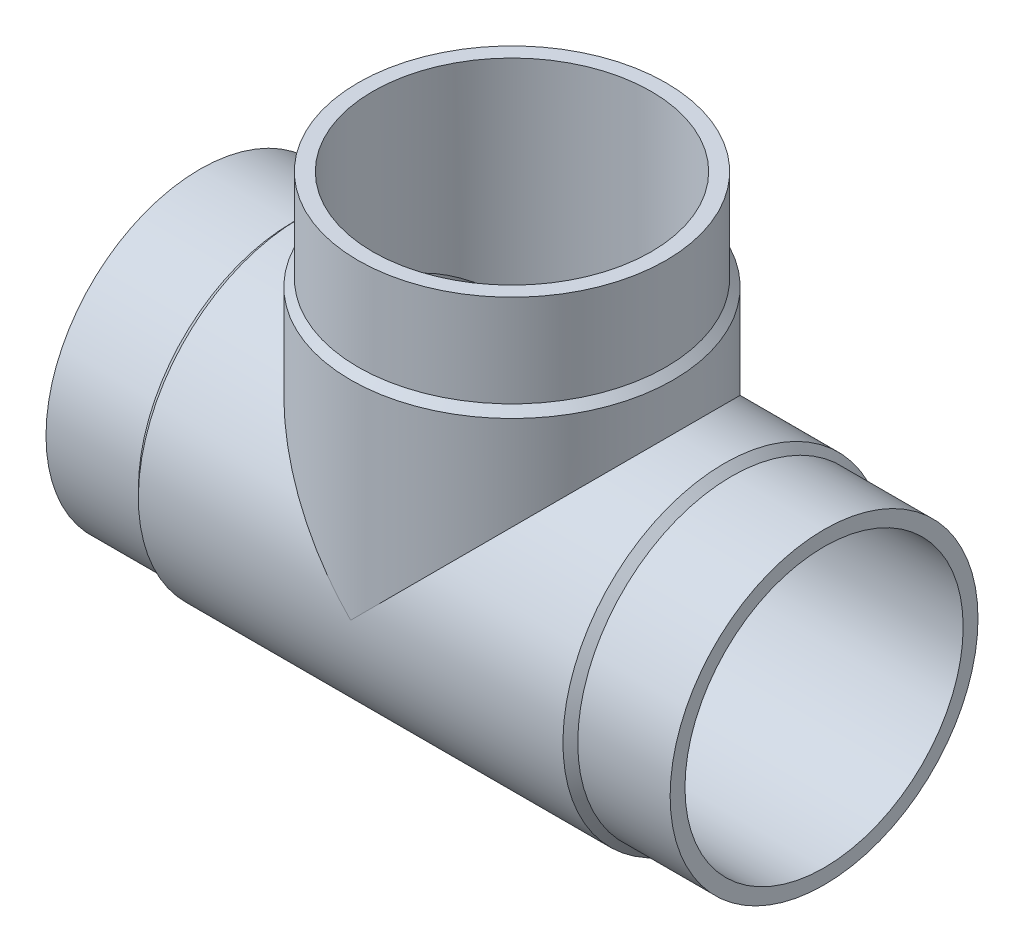
ISO-10303-21;
HEADER;
FILE_DESCRIPTION(('STEP AP214'),'2;1');
FILE_NAME('part.step','',(''),(''),'','','');
FILE_SCHEMA(('AUTOMOTIVE_DESIGN { 1 0 10303 214 1 1 1 1 }'));
ENDSEC;
DATA;
#1=APPLICATION_CONTEXT('core data for automotive mechanical design processes');
#2=APPLICATION_PROTOCOL_DEFINITION('international standard','automotive_design',2000,#1);
#3=PRODUCT_CONTEXT('',#1,'mechanical');
#4=PRODUCT('Part','Part','',(#3));
#5=PRODUCT_RELATED_PRODUCT_CATEGORY('part','',(#4));
#6=PRODUCT_DEFINITION_FORMATION('','',#4);
#7=PRODUCT_DEFINITION_CONTEXT('part definition',#1,'design');
#8=PRODUCT_DEFINITION('design','',#6,#7);
#9=PRODUCT_DEFINITION_SHAPE('','',#8);
#10=(LENGTH_UNIT() NAMED_UNIT(*) SI_UNIT(.MILLI.,.METRE.));
#11=(NAMED_UNIT(*) PLANE_ANGLE_UNIT() SI_UNIT($,.RADIAN.));
#12=(NAMED_UNIT(*) SI_UNIT($,.STERADIAN.) SOLID_ANGLE_UNIT());
#13=UNCERTAINTY_MEASURE_WITH_UNIT(LENGTH_MEASURE(1.E-05),#10,'distance_accuracy_value','');
#14=(GEOMETRIC_REPRESENTATION_CONTEXT(3) GLOBAL_UNCERTAINTY_ASSIGNED_CONTEXT((#13)) GLOBAL_UNIT_ASSIGNED_CONTEXT((#10,
#11,#12)) REPRESENTATION_CONTEXT('',''));
#15=CARTESIAN_POINT('',(0.,0.,0.));
#16=DIRECTION('',(0.,0.,1.));
#17=DIRECTION('',(1.,0.,0.));
#18=AXIS2_PLACEMENT_3D('',#15,#16,#17);
#19=CARTESIAN_POINT('',(-111.5,110.,0.));
#20=DIRECTION('',(0.,1.,0.));
#21=DIRECTION('',(0.,0.,1.));
#22=AXIS2_PLACEMENT_3D('',#19,#20,#21);
#23=CYLINDRICAL_SURFACE('',#22,55.);
#24=CARTESIAN_POINT('',(-111.5,110.,0.));
#25=DIRECTION('',(0.,1.,0.));
#26=DIRECTION('',(0.,0.,1.));
#27=AXIS2_PLACEMENT_3D('',#24,#25,#26);
#28=CIRCLE('',#27,55.);
#29=CARTESIAN_POINT('',(-111.5,110.,55.));
#30=VERTEX_POINT('',#29);
#31=EDGE_CURVE('E18',#30,#30,#28,.T.);
#32=ORIENTED_EDGE('',*,*,#31,.F.);
#33=EDGE_LOOP('',(#32));
#34=FACE_BOUND('',#33,.T.);
#35=CARTESIAN_POINT('',(-111.5,77.,0.));
#36=DIRECTION('',(0.,1.,0.));
#37=DIRECTION('',(1.,0.,0.));
#38=AXIS2_PLACEMENT_3D('',#35,#36,#37);
#39=CIRCLE('',#38,55.);
#40=CARTESIAN_POINT('',(-56.5,77.,0.));
#41=VERTEX_POINT('',#40);
#42=EDGE_CURVE('E71',#41,#41,#39,.F.);
#43=ORIENTED_EDGE('',*,*,#42,.F.);
#44=EDGE_LOOP('',(#43));
#45=FACE_BOUND('',#44,.T.);
#46=ADVANCED_FACE('F15',(#34,#45),#23,.T.);
#47=CARTESIAN_POINT('',(-111.5,77.,0.));
#48=DIRECTION('',(0.,-1.,0.));
#49=DIRECTION('',(0.,0.,-1.));
#50=AXIS2_PLACEMENT_3D('',#47,#48,#49);
#51=CONICAL_SURFACE('',#50,55.,0.785398163397453);
#52=CARTESIAN_POINT('',(-111.5,74.35,0.));
#53=DIRECTION('',(0.,1.,0.));
#54=DIRECTION('',(1.,0.,0.));
#55=AXIS2_PLACEMENT_3D('',#52,#53,#54);
#56=CIRCLE('',#55,57.65);
#57=CARTESIAN_POINT('',(-53.85,74.35,0.));
#58=VERTEX_POINT('',#57);
#59=EDGE_CURVE('E60',#58,#58,#56,.F.);
#60=ORIENTED_EDGE('',*,*,#59,.F.);
#61=EDGE_LOOP('',(#60));
#62=FACE_BOUND('',#61,.T.);
#63=ORIENTED_EDGE('',*,*,#42,.T.);
#64=EDGE_LOOP('',(#63));
#65=FACE_BOUND('',#64,.T.);
#66=ADVANCED_FACE('F141',(#62,#65),#51,.T.);
#67=CARTESIAN_POINT('',(-33.,0.,0.));
#68=DIRECTION('',(-1.,0.,0.));
#69=DIRECTION('',(0.,0.,1.));
#70=AXIS2_PLACEMENT_3D('',#67,#68,#69);
#71=CYLINDRICAL_SURFACE('',#70,55.);
#72=CARTESIAN_POINT('',(-33.,0.,0.));
#73=DIRECTION('',(1.,0.,0.));
#74=DIRECTION('',(0.,1.,0.));
#75=AXIS2_PLACEMENT_3D('',#72,#73,#74);
#76=CIRCLE('',#75,55.);
#77=CARTESIAN_POINT('',(-33.,55.,0.));
#78=VERTEX_POINT('',#77);
#79=EDGE_CURVE('E64',#78,#78,#76,.F.);
#80=ORIENTED_EDGE('',*,*,#79,.F.);
#81=EDGE_LOOP('',(#80));
#82=FACE_BOUND('',#81,.T.);
#83=CARTESIAN_POINT('',(0.,0.,0.));
#84=DIRECTION('',(-1.,0.,0.));
#85=DIRECTION('',(0.,0.,1.));
#86=AXIS2_PLACEMENT_3D('',#83,#84,#85);
#87=CIRCLE('',#86,55.);
#88=CARTESIAN_POINT('',(0.,0.,55.));
#89=VERTEX_POINT('',#88);
#90=EDGE_CURVE('E58',#89,#89,#87,.F.);
#91=ORIENTED_EDGE('',*,*,#90,.F.);
#92=EDGE_LOOP('',(#91));
#93=FACE_BOUND('',#92,.T.);
#94=ADVANCED_FACE('F136',(#82,#93),#71,.T.);
#95=CARTESIAN_POINT('',(-166.5,110.,55.660002108172));
#96=DIRECTION('',(0.,1.,0.));
#97=DIRECTION('',(1.,0.,0.));
#98=AXIS2_PLACEMENT_3D('',#95,#96,#97);
#99=PLANE('',#98);
#100=CARTESIAN_POINT('',(-111.5,110.,0.));
#101=DIRECTION('',(0.,1.,0.));
#102=DIRECTION('',(0.,0.,1.));
#103=AXIS2_PLACEMENT_3D('',#100,#101,#102);
#104=CIRCLE('',#103,49.7);
#105=CARTESIAN_POINT('',(-111.5,110.,49.7));
#106=VERTEX_POINT('',#105);
#107=EDGE_CURVE('E52',#106,#106,#104,.T.);
#108=ORIENTED_EDGE('',*,*,#107,.F.);
#109=EDGE_LOOP('',(#108));
#110=FACE_BOUND('',#109,.T.);
#111=ORIENTED_EDGE('',*,*,#31,.T.);
#112=EDGE_LOOP('',(#111));
#113=FACE_BOUND('',#112,.T.);
#114=ADVANCED_FACE('F130',(#110,#113),#99,.T.);
#115=CARTESIAN_POINT('',(-33.,0.,0.));
#116=DIRECTION('',(-1.,0.,0.));
#117=DIRECTION('',(0.,0.,1.));
#118=AXIS2_PLACEMENT_3D('',#115,#116,#117);
#119=CONICAL_SURFACE('',#118,55.,0.785398163397443);
#120=ORIENTED_EDGE('',*,*,#79,.T.);
#121=EDGE_LOOP('',(#120));
#122=FACE_BOUND('',#121,.T.);
#123=CARTESIAN_POINT('',(-35.65,0.,0.));
#124=DIRECTION('',(-1.,0.,0.));
#125=DIRECTION('',(0.,1.,0.));
#126=AXIS2_PLACEMENT_3D('',#123,#124,#125);
#127=CIRCLE('',#126,57.65);
#128=CARTESIAN_POINT('',(-35.65,57.65,0.));
#129=VERTEX_POINT('',#128);
#130=EDGE_CURVE('E49',#129,#129,#127,.T.);
#131=ORIENTED_EDGE('',*,*,#130,.F.);
#132=EDGE_LOOP('',(#131));
#133=FACE_BOUND('',#132,.T.);
#134=ADVANCED_FACE('F95',(#122,#133),#119,.T.);
#135=CARTESIAN_POINT('',(-111.5,74.35,0.));
#136=DIRECTION('',(0.,1.,0.));
#137=DIRECTION('',(0.,0.,1.));
#138=AXIS2_PLACEMENT_3D('',#135,#136,#137);
#139=CYLINDRICAL_SURFACE('',#138,57.65);
#140=CARTESIAN_POINT('',(-111.5,0.,0.));
#141=DIRECTION('',(0.707106781186547,0.707106781186547,0.));
#142=DIRECTION('',(-0.707106781186547,0.707106781186547,0.));
#143=AXIS2_PLACEMENT_3D('',#140,#141,#142);
#144=ELLIPSE('',#143,81.5294118708089,57.65);
#145=CARTESIAN_POINT('',(-111.5,0.,57.65));
#146=VERTEX_POINT('',#145);
#147=CARTESIAN_POINT('',(-111.5,0.,-57.65));
#148=VERTEX_POINT('',#147);
#149=EDGE_CURVE('E44',#146,#148,#144,.F.);
#150=ORIENTED_EDGE('',*,*,#149,.F.);
#151=CARTESIAN_POINT('',(-111.5,0.,0.));
#152=DIRECTION('',(-0.707106781186547,0.707106781186547,0.));
#153=DIRECTION('',(-0.707106781186547,-0.707106781186547,0.));
#154=AXIS2_PLACEMENT_3D('',#151,#152,#153);
#155=ELLIPSE('',#154,81.5294118708089,57.65);
#156=EDGE_CURVE('E40',#148,#146,#155,.F.);
#157=ORIENTED_EDGE('',*,*,#156,.F.);
#158=EDGE_LOOP('',(#150,#157));
#159=FACE_BOUND('',#158,.T.);
#160=ORIENTED_EDGE('',*,*,#59,.T.);
#161=EDGE_LOOP('',(#160));
#162=FACE_BOUND('',#161,.T.);
#163=ADVANCED_FACE('F47',(#159,#162),#139,.T.);
#164=CARTESIAN_POINT('',(0.,55.,55.6600021081709));
#165=DIRECTION('',(1.,0.,0.));
#166=DIRECTION('',(0.,-1.,0.));
#167=AXIS2_PLACEMENT_3D('',#164,#165,#166);
#168=PLANE('',#167);
#169=CARTESIAN_POINT('',(0.,0.,0.));
#170=DIRECTION('',(-1.,0.,0.));
#171=DIRECTION('',(0.,0.,1.));
#172=AXIS2_PLACEMENT_3D('',#169,#170,#171);
#173=CIRCLE('',#172,49.7);
#174=CARTESIAN_POINT('',(0.,0.,49.7));
#175=VERTEX_POINT('',#174);
#176=EDGE_CURVE('E45',#175,#175,#173,.F.);
#177=ORIENTED_EDGE('',*,*,#176,.F.);
#178=EDGE_LOOP('',(#177));
#179=FACE_BOUND('',#178,.T.);
#180=ORIENTED_EDGE('',*,*,#90,.T.);
#181=EDGE_LOOP('',(#180));
#182=FACE_BOUND('',#181,.T.);
#183=ADVANCED_FACE('F85',(#179,#182),#168,.T.);
#184=CARTESIAN_POINT('',(-111.5,0.,0.));
#185=DIRECTION('',(0.,1.,0.));
#186=DIRECTION('',(0.,0.,1.));
#187=AXIS2_PLACEMENT_3D('',#184,#185,#186);
#188=CYLINDRICAL_SURFACE('',#187,49.7);
#189=CARTESIAN_POINT('',(-111.5,0.,0.));
#190=DIRECTION('',(-0.707106781186547,-0.707106781186547,0.));
#191=DIRECTION('',(-0.707106781186547,0.707106781186547,0.));
#192=AXIS2_PLACEMENT_3D('',#189,#190,#191);
#193=ELLIPSE('',#192,70.2864140499428,49.7);
#194=CARTESIAN_POINT('',(-111.5,0.,-49.7));
#195=VERTEX_POINT('',#194);
#196=CARTESIAN_POINT('',(-111.5,0.,49.7));
#197=VERTEX_POINT('',#196);
#198=EDGE_CURVE('E78',#195,#197,#193,.F.);
#199=ORIENTED_EDGE('',*,*,#198,.F.);
#200=CARTESIAN_POINT('',(-111.5,0.,0.));
#201=DIRECTION('',(-0.707106781186547,0.707106781186547,0.));
#202=DIRECTION('',(0.707106781186547,0.707106781186547,0.));
#203=AXIS2_PLACEMENT_3D('',#200,#201,#202);
#204=ELLIPSE('',#203,70.2864140499428,49.7);
#205=EDGE_CURVE('E32',#195,#197,#204,.F.);
#206=ORIENTED_EDGE('',*,*,#205,.T.);
#207=EDGE_LOOP('',(#199,#206));
#208=FACE_BOUND('',#207,.T.);
#209=ORIENTED_EDGE('',*,*,#107,.T.);
#210=EDGE_LOOP('',(#209));
#211=FACE_BOUND('',#210,.T.);
#212=ADVANCED_FACE('F87',(#208,#211),#188,.F.);
#213=CARTESIAN_POINT('',(-187.35,0.,0.));
#214=DIRECTION('',(-1.,0.,0.));
#215=DIRECTION('',(0.,0.,1.));
#216=AXIS2_PLACEMENT_3D('',#213,#214,#215);
#217=CYLINDRICAL_SURFACE('',#216,57.65);
#218=ORIENTED_EDGE('',*,*,#130,.T.);
#219=EDGE_LOOP('',(#218));
#220=FACE_BOUND('',#219,.T.);
#221=CARTESIAN_POINT('',(-187.35,0.,0.));
#222=DIRECTION('',(-1.,0.,0.));
#223=DIRECTION('',(0.,1.,0.));
#224=AXIS2_PLACEMENT_3D('',#221,#222,#223);
#225=CIRCLE('',#224,57.65);
#226=CARTESIAN_POINT('',(-187.35,57.65,0.));
#227=VERTEX_POINT('',#226);
#228=EDGE_CURVE('E77',#227,#227,#225,.T.);
#229=ORIENTED_EDGE('',*,*,#228,.F.);
#230=EDGE_LOOP('',(#229));
#231=FACE_BOUND('',#230,.T.);
#232=ORIENTED_EDGE('',*,*,#149,.T.);
#233=ORIENTED_EDGE('',*,*,#156,.T.);
#234=EDGE_LOOP('',(#232,#233));
#235=FACE_BOUND('',#234,.T.);
#236=ADVANCED_FACE('F43',(#220,#231,#235),#217,.T.);
#237=CARTESIAN_POINT('',(-111.5,0.,0.));
#238=DIRECTION('',(-1.,0.,0.));
#239=DIRECTION('',(0.,0.,1.));
#240=AXIS2_PLACEMENT_3D('',#237,#238,#239);
#241=CYLINDRICAL_SURFACE('',#240,49.7);
#242=ORIENTED_EDGE('',*,*,#205,.F.);
#243=ORIENTED_EDGE('',*,*,#198,.T.);
#244=EDGE_LOOP('',(#242,#243));
#245=FACE_BOUND('',#244,.T.);
#246=ORIENTED_EDGE('',*,*,#176,.T.);
#247=EDGE_LOOP('',(#246));
#248=FACE_BOUND('',#247,.T.);
#249=CARTESIAN_POINT('',(-223.,0.,0.));
#250=DIRECTION('',(-1.,0.,0.));
#251=DIRECTION('',(0.,0.,1.));
#252=AXIS2_PLACEMENT_3D('',#249,#250,#251);
#253=CIRCLE('',#252,49.7);
#254=CARTESIAN_POINT('',(-223.,0.,49.7));
#255=VERTEX_POINT('',#254);
#256=EDGE_CURVE('E74',#255,#255,#253,.F.);
#257=ORIENTED_EDGE('',*,*,#256,.F.);
#258=EDGE_LOOP('',(#257));
#259=FACE_BOUND('',#258,.T.);
#260=ADVANCED_FACE('F82',(#245,#248,#259),#241,.F.);
#261=CARTESIAN_POINT('',(-190.,0.,0.));
#262=DIRECTION('',(1.,0.,0.));
#263=DIRECTION('',(0.,0.,-1.));
#264=AXIS2_PLACEMENT_3D('',#261,#262,#263);
#265=CONICAL_SURFACE('',#264,55.,0.785398163397441);
#266=ORIENTED_EDGE('',*,*,#228,.T.);
#267=EDGE_LOOP('',(#266));
#268=FACE_BOUND('',#267,.T.);
#269=CARTESIAN_POINT('',(-190.,0.,0.));
#270=DIRECTION('',(-1.,0.,0.));
#271=DIRECTION('',(0.,1.,0.));
#272=AXIS2_PLACEMENT_3D('',#269,#270,#271);
#273=CIRCLE('',#272,55.);
#274=CARTESIAN_POINT('',(-190.,55.,0.));
#275=VERTEX_POINT('',#274);
#276=EDGE_CURVE('E24',#275,#275,#273,.T.);
#277=ORIENTED_EDGE('',*,*,#276,.F.);
#278=EDGE_LOOP('',(#277));
#279=FACE_BOUND('',#278,.T.);
#280=ADVANCED_FACE('F105',(#268,#279),#265,.T.);
#281=CARTESIAN_POINT('',(-223.,-55.,55.660002108172));
#282=DIRECTION('',(-1.,0.,0.));
#283=DIRECTION('',(0.,1.,0.));
#284=AXIS2_PLACEMENT_3D('',#281,#282,#283);
#285=PLANE('',#284);
#286=ORIENTED_EDGE('',*,*,#256,.T.);
#287=EDGE_LOOP('',(#286));
#288=FACE_BOUND('',#287,.T.);
#289=CARTESIAN_POINT('',(-223.,0.,0.));
#290=DIRECTION('',(-1.,0.,0.));
#291=DIRECTION('',(0.,0.,1.));
#292=AXIS2_PLACEMENT_3D('',#289,#290,#291);
#293=CIRCLE('',#292,55.);
#294=CARTESIAN_POINT('',(-223.,0.,55.));
#295=VERTEX_POINT('',#294);
#296=EDGE_CURVE('E9',#295,#295,#293,.F.);
#297=ORIENTED_EDGE('',*,*,#296,.F.);
#298=EDGE_LOOP('',(#297));
#299=FACE_BOUND('',#298,.T.);
#300=ADVANCED_FACE('F99',(#288,#299),#285,.T.);
#301=CARTESIAN_POINT('',(-223.,0.,0.));
#302=DIRECTION('',(-1.,0.,0.));
#303=DIRECTION('',(0.,0.,1.));
#304=AXIS2_PLACEMENT_3D('',#301,#302,#303);
#305=CYLINDRICAL_SURFACE('',#304,55.);
#306=ORIENTED_EDGE('',*,*,#276,.T.);
#307=EDGE_LOOP('',(#306));
#308=FACE_BOUND('',#307,.T.);
#309=ORIENTED_EDGE('',*,*,#296,.T.);
#310=EDGE_LOOP('',(#309));
#311=FACE_BOUND('',#310,.T.);
#312=ADVANCED_FACE('F97',(#308,#311),#305,.T.);
#313=CLOSED_SHELL('',(#46,#66,#94,#114,#134,#163,#183,#212,#236,#260,#280,#300,#312));
#314=MANIFOLD_SOLID_BREP('B1',#313);
#315=ADVANCED_BREP_SHAPE_REPRESENTATION('',(#18,#314),#14);
#316=SHAPE_DEFINITION_REPRESENTATION(#9,#315);
ENDSEC;
END-ISO-10303-21;
